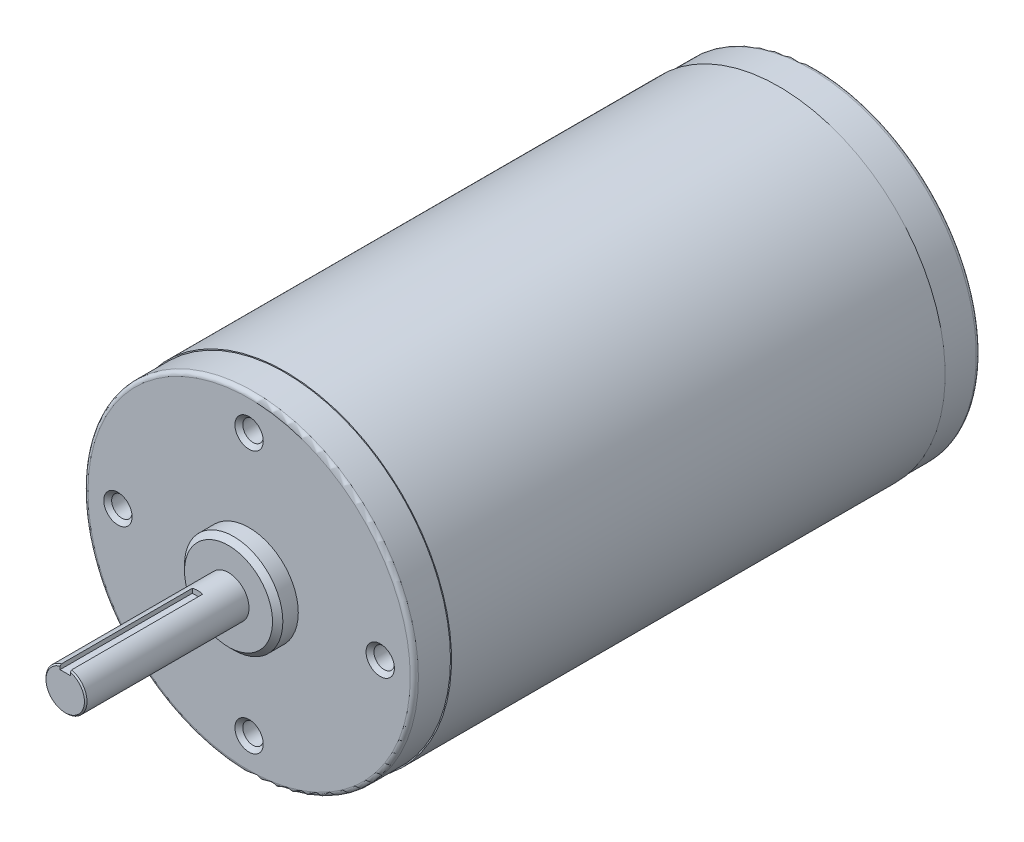
ISO-10303-21;
HEADER;
FILE_DESCRIPTION(('STEP AP214'),'2;1');
FILE_NAME('part.step','',(''),(''),'','','');
FILE_SCHEMA(('AUTOMOTIVE_DESIGN { 1 0 10303 214 1 1 1 1 }'));
ENDSEC;
DATA;
#1=APPLICATION_CONTEXT('core data for automotive mechanical design processes');
#2=APPLICATION_PROTOCOL_DEFINITION('international standard','automotive_design',2000,#1);
#3=PRODUCT_CONTEXT('',#1,'mechanical');
#4=PRODUCT('Part','Part','',(#3));
#5=PRODUCT_RELATED_PRODUCT_CATEGORY('part','',(#4));
#6=PRODUCT_DEFINITION_FORMATION('','',#4);
#7=PRODUCT_DEFINITION_CONTEXT('part definition',#1,'design');
#8=PRODUCT_DEFINITION('design','',#6,#7);
#9=PRODUCT_DEFINITION_SHAPE('','',#8);
#10=(LENGTH_UNIT() NAMED_UNIT(*) SI_UNIT(.MILLI.,.METRE.));
#11=(NAMED_UNIT(*) PLANE_ANGLE_UNIT() SI_UNIT($,.RADIAN.));
#12=(NAMED_UNIT(*) SI_UNIT($,.STERADIAN.) SOLID_ANGLE_UNIT());
#13=UNCERTAINTY_MEASURE_WITH_UNIT(LENGTH_MEASURE(1.E-05),#10,'distance_accuracy_value','');
#14=(GEOMETRIC_REPRESENTATION_CONTEXT(3) GLOBAL_UNCERTAINTY_ASSIGNED_CONTEXT((#13)) GLOBAL_UNIT_ASSIGNED_CONTEXT((#10,
#11,#12)) REPRESENTATION_CONTEXT('',''));
#15=CARTESIAN_POINT('',(0.,0.,0.));
#16=DIRECTION('',(0.,0.,1.));
#17=DIRECTION('',(1.,0.,0.));
#18=AXIS2_PLACEMENT_3D('',#15,#16,#17);
#19=CARTESIAN_POINT('',(0.,0.,42.6107999999999));
#20=DIRECTION('',(0.,0.,-1.));
#21=DIRECTION('',(-1.,0.,0.));
#22=AXIS2_PLACEMENT_3D('',#19,#20,#21);
#23=PLANE('',#22);
#24=DIRECTION('',(0.,1.,0.));
#25=VECTOR('',#24,1.);
#26=CARTESIAN_POINT('',(1.,0.,42.6107999999999));
#27=LINE('',#26,#25);
#28=CARTESIAN_POINT('',(1.,2.99999999999999,42.6107999999999));
#29=VERTEX_POINT('',#28);
#30=CARTESIAN_POINT('',(1.,3.58836592483648,42.610800000017));
#31=VERTEX_POINT('',#30);
#32=EDGE_CURVE('E108',#29,#31,#27,.T.);
#33=ORIENTED_EDGE('',*,*,#32,.F.);
#34=DIRECTION('',(1.,0.,0.));
#35=VECTOR('',#34,1.);
#36=CARTESIAN_POINT('',(-1.,2.99999999999999,42.6107999999999));
#37=LINE('',#36,#35);
#38=CARTESIAN_POINT('',(-1.,2.99999999999999,42.6107999999999));
#39=VERTEX_POINT('',#38);
#40=EDGE_CURVE('E74',#29,#39,#37,.F.);
#41=ORIENTED_EDGE('',*,*,#40,.T.);
#42=DIRECTION('',(0.,1.,0.));
#43=VECTOR('',#42,1.);
#44=CARTESIAN_POINT('',(-1.,0.,42.6107999999999));
#45=LINE('',#44,#43);
#46=CARTESIAN_POINT('',(-1.,3.58836592483648,42.610800000017));
#47=VERTEX_POINT('',#46);
#48=EDGE_CURVE('E55',#47,#39,#45,.F.);
#49=ORIENTED_EDGE('',*,*,#48,.F.);
#50=CARTESIAN_POINT('',(0.,0.,42.610800000034));
#51=DIRECTION('',(0.,0.,-1.));
#52=DIRECTION('',(-1.,0.,0.));
#53=AXIS2_PLACEMENT_3D('',#50,#51,#52);
#54=CIRCLE('',#53,3.72510000005377);
#55=EDGE_CURVE('E20',#31,#47,#54,.T.);
#56=ORIENTED_EDGE('',*,*,#55,.F.);
#57=EDGE_LOOP('',(#33,#41,#49,#56));
#58=FACE_BOUND('',#57,.T.);
#59=ADVANCED_FACE('F17',(#58),#23,.F.);
#60=CARTESIAN_POINT('',(-1.,2.99999999999999,42.6107999999999));
#61=DIRECTION('',(0.,-1.,0.));
#62=DIRECTION('',(0.,0.,-1.));
#63=AXIS2_PLACEMENT_3D('',#60,#61,#62);
#64=PLANE('',#63);
#65=DIRECTION('',(0.,0.,1.));
#66=VECTOR('',#65,1.);
#67=CARTESIAN_POINT('',(-1.,2.99999999999999,42.6107999999999));
#68=LINE('',#67,#66);
#69=CARTESIAN_POINT('',(-1.,2.99999999999999,16.9822));
#70=VERTEX_POINT('',#69);
#71=EDGE_CURVE('E111',#70,#39,#68,.T.);
#72=ORIENTED_EDGE('',*,*,#71,.T.);
#73=ORIENTED_EDGE('',*,*,#40,.F.);
#74=DIRECTION('',(0.,0.,-1.));
#75=VECTOR('',#74,1.);
#76=CARTESIAN_POINT('',(1.,2.99999999999999,42.6107999999999));
#77=LINE('',#76,#75);
#78=CARTESIAN_POINT('',(1.,2.99999999999999,16.9822));
#79=VERTEX_POINT('',#78);
#80=EDGE_CURVE('E70',#29,#79,#77,.T.);
#81=ORIENTED_EDGE('',*,*,#80,.T.);
#82=DIRECTION('',(1.,0.,0.));
#83=VECTOR('',#82,1.);
#84=CARTESIAN_POINT('',(0.,2.99999999999999,16.9822));
#85=LINE('',#84,#83);
#86=EDGE_CURVE('E73',#70,#79,#85,.T.);
#87=ORIENTED_EDGE('',*,*,#86,.F.);
#88=EDGE_LOOP('',(#72,#73,#81,#87));
#89=FACE_BOUND('',#88,.T.);
#90=ADVANCED_FACE('F72',(#89),#64,.F.);
#91=CARTESIAN_POINT('',(0.,0.,42.3608000000968));
#92=DIRECTION('',(0.,0.,-1.));
#93=DIRECTION('',(-1.,0.,0.));
#94=AXIS2_PLACEMENT_3D('',#91,#92,#93);
#95=CONICAL_SURFACE('',#94,3.97509999993417,0.785398163283761);
#96=CARTESIAN_POINT('',(1.,3.84726136493472,42.3608000000159));
#97=CARTESIAN_POINT('',(1.,3.80416108609981,42.4025173690307));
#98=CARTESIAN_POINT('',(1.,3.76103632691394,42.4442093866405));
#99=CARTESIAN_POINT('',(1.,3.67473784687307,42.5275427199842));
#100=CARTESIAN_POINT('',(1.,3.63156412601698,42.569184035717));
#101=CARTESIAN_POINT('',(1.,3.58836592480883,42.6108000000436));
#102=B_SPLINE_CURVE_WITH_KNOTS('',3,(#96,#97,#98,#99,#100,#101),.UNSPECIFIED.,.F.,.F.,(4,2,4),
(0.,0.179949222518309,0.359898449070208),.UNSPECIFIED.);
#103=CARTESIAN_POINT('',(1.,3.84726136492696,42.3608000000079));
#104=VERTEX_POINT('',#103);
#105=EDGE_CURVE('E88',#104,#31,#102,.T.);
#106=ORIENTED_EDGE('',*,*,#105,.T.);
#107=ORIENTED_EDGE('',*,*,#55,.T.);
#108=CARTESIAN_POINT('',(-1.,3.58836592480883,42.6108000000436));
#109=CARTESIAN_POINT('',(-1.,3.63156412601698,42.569184035717));
#110=CARTESIAN_POINT('',(-1.,3.67473784687307,42.5275427199842));
#111=CARTESIAN_POINT('',(-1.,3.76103632691394,42.4442093866405));
#112=CARTESIAN_POINT('',(-1.,3.80416108609981,42.4025173690307));
#113=CARTESIAN_POINT('',(-1.,3.84726136493472,42.3608000000159));
#114=B_SPLINE_CURVE_WITH_KNOTS('',3,(#108,#109,#110,#111,#112,#113),.UNSPECIFIED.,.F.,.F.,(4,2,
4),(0.,0.179949226551899,0.359898449070214),.UNSPECIFIED.);
#115=CARTESIAN_POINT('',(-1.,3.84726136492696,42.3608000000079));
#116=VERTEX_POINT('',#115);
#117=EDGE_CURVE('E81',#47,#116,#114,.T.);
#118=ORIENTED_EDGE('',*,*,#117,.T.);
#119=CARTESIAN_POINT('',(0.,0.,42.3607999999999));
#120=DIRECTION('',(0.,0.,1.));
#121=DIRECTION('',(1.,0.,0.));
#122=AXIS2_PLACEMENT_3D('',#119,#120,#121);
#123=CIRCLE('',#122,3.9751);
#124=EDGE_CURVE('E91',#104,#116,#123,.F.);
#125=ORIENTED_EDGE('',*,*,#124,.F.);
#126=EDGE_LOOP('',(#106,#107,#118,#125));
#127=FACE_BOUND('',#126,.T.);
#128=ADVANCED_FACE('F199',(#127),#95,.T.);
#129=CARTESIAN_POINT('',(-1.,3.84726136491921,42.6107999999999));
#130=DIRECTION('',(-1.,0.,0.));
#131=DIRECTION('',(0.,0.,1.));
#132=AXIS2_PLACEMENT_3D('',#129,#130,#131);
#133=PLANE('',#132);
#134=ORIENTED_EDGE('',*,*,#48,.T.);
#135=ORIENTED_EDGE('',*,*,#71,.F.);
#136=DIRECTION('',(0.,-1.,0.));
#137=VECTOR('',#136,1.);
#138=CARTESIAN_POINT('',(-1.,3.45234055060212,16.9822));
#139=LINE('',#138,#137);
#140=CARTESIAN_POINT('',(-1.,3.84726136491921,16.9822));
#141=VERTEX_POINT('',#140);
#142=EDGE_CURVE('E77',#141,#70,#139,.T.);
#143=ORIENTED_EDGE('',*,*,#142,.F.);
#144=DIRECTION('',(0.,0.,1.));
#145=VECTOR('',#144,1.);
#146=CARTESIAN_POINT('',(-1.,3.84726136491921,10.9878));
#147=LINE('',#146,#145);
#148=EDGE_CURVE('E100',#116,#141,#147,.F.);
#149=ORIENTED_EDGE('',*,*,#148,.F.);
#150=ORIENTED_EDGE('',*,*,#117,.F.);
#151=EDGE_LOOP('',(#134,#135,#143,#149,#150));
#152=FACE_BOUND('',#151,.T.);
#153=ADVANCED_FACE('F202',(#152),#133,.F.);
#154=CARTESIAN_POINT('',(0.,3.45234055060212,16.9822));
#155=DIRECTION('',(0.,0.,1.));
#156=DIRECTION('',(0.,-1.,0.));
#157=AXIS2_PLACEMENT_3D('',#154,#155,#156);
#158=PLANE('',#157);
#159=CARTESIAN_POINT('',(0.,0.,16.9822));
#160=DIRECTION('',(0.,0.,1.));
#161=DIRECTION('',(1.,0.,0.));
#162=AXIS2_PLACEMENT_3D('',#159,#160,#161);
#163=CIRCLE('',#162,3.9751);
#164=CARTESIAN_POINT('',(1.,3.84726136491921,16.9822));
#165=VERTEX_POINT('',#164);
#166=EDGE_CURVE('E186',#141,#165,#163,.F.);
#167=ORIENTED_EDGE('',*,*,#166,.F.);
#168=ORIENTED_EDGE('',*,*,#142,.T.);
#169=ORIENTED_EDGE('',*,*,#86,.T.);
#170=DIRECTION('',(0.,1.,0.));
#171=VECTOR('',#170,1.);
#172=CARTESIAN_POINT('',(1.,2.99999999999999,16.9822));
#173=LINE('',#172,#171);
#174=EDGE_CURVE('E35',#79,#165,#173,.T.);
#175=ORIENTED_EDGE('',*,*,#174,.T.);
#176=EDGE_LOOP('',(#167,#168,#169,#175));
#177=FACE_BOUND('',#176,.T.);
#178=ADVANCED_FACE('F80',(#177),#158,.T.);
#179=CARTESIAN_POINT('',(1.,2.99999999999999,42.6107999999999));
#180=DIRECTION('',(1.,0.,0.));
#181=DIRECTION('',(0.,0.,-1.));
#182=AXIS2_PLACEMENT_3D('',#179,#180,#181);
#183=PLANE('',#182);
#184=DIRECTION('',(0.,0.,1.));
#185=VECTOR('',#184,1.);
#186=CARTESIAN_POINT('',(1.,3.84726136491921,10.9878));
#187=LINE('',#186,#185);
#188=EDGE_CURVE('E86',#165,#104,#187,.T.);
#189=ORIENTED_EDGE('',*,*,#188,.F.);
#190=ORIENTED_EDGE('',*,*,#174,.F.);
#191=ORIENTED_EDGE('',*,*,#80,.F.);
#192=ORIENTED_EDGE('',*,*,#32,.T.);
#193=ORIENTED_EDGE('',*,*,#105,.F.);
#194=EDGE_LOOP('',(#189,#190,#191,#192,#193));
#195=FACE_BOUND('',#194,.T.);
#196=ADVANCED_FACE('F83',(#195),#183,.F.);
#197=CARTESIAN_POINT('',(0.,25.4,-98.7955999999999));
#198=DIRECTION('',(0.,0.,-1.));
#199=DIRECTION('',(-1.,0.,0.));
#200=AXIS2_PLACEMENT_3D('',#197,#198,#199);
#201=CYLINDRICAL_SURFACE('',#200,2.54);
#202=CARTESIAN_POINT('',(0.,25.4,-94.9856000000295));
#203=DIRECTION('',(0.,0.,-1.));
#204=DIRECTION('',(-1.,0.,0.));
#205=AXIS2_PLACEMENT_3D('',#202,#203,#204);
#206=CIRCLE('',#205,2.54000000006727);
#207=CARTESIAN_POINT('',(-2.54000000006727,25.4,-94.9856000000295));
#208=VERTEX_POINT('',#207);
#209=EDGE_CURVE('E179',#208,#208,#206,.F.);
#210=ORIENTED_EDGE('',*,*,#209,.T.);
#211=EDGE_LOOP('',(#210));
#212=FACE_BOUND('',#211,.T.);
#213=CARTESIAN_POINT('',(0.,25.4,-98.0336));
#214=DIRECTION('',(0.,0.,-1.));
#215=DIRECTION('',(-1.,0.,0.));
#216=AXIS2_PLACEMENT_3D('',#213,#214,#215);
#217=CIRCLE('',#216,2.54);
#218=CARTESIAN_POINT('',(-2.54,25.4,-98.0336));
#219=VERTEX_POINT('',#218);
#220=EDGE_CURVE('E180',#219,#219,#217,.F.);
#221=ORIENTED_EDGE('',*,*,#220,.F.);
#222=EDGE_LOOP('',(#221));
#223=FACE_BOUND('',#222,.T.);
#224=ADVANCED_FACE('F383',(#212,#223),#201,.F.);
#225=CARTESIAN_POINT('',(0.,0.,10.9878));
#226=DIRECTION('',(0.,0.,1.));
#227=DIRECTION('',(1.,0.,0.));
#228=AXIS2_PLACEMENT_3D('',#225,#226,#227);
#229=CYLINDRICAL_SURFACE('',#228,3.9751);
#230=CARTESIAN_POINT('',(0.,0.,10.9878));
#231=DIRECTION('',(0.,0.,1.));
#232=DIRECTION('',(1.,0.,0.));
#233=AXIS2_PLACEMENT_3D('',#230,#231,#232);
#234=CIRCLE('',#233,3.9751);
#235=CARTESIAN_POINT('',(3.9751,0.,10.9878));
#236=VERTEX_POINT('',#235);
#237=EDGE_CURVE('E176',#236,#236,#234,.T.);
#238=ORIENTED_EDGE('',*,*,#237,.T.);
#239=EDGE_LOOP('',(#238));
#240=FACE_BOUND('',#239,.T.);
#241=ORIENTED_EDGE('',*,*,#166,.T.);
#242=ORIENTED_EDGE('',*,*,#188,.T.);
#243=ORIENTED_EDGE('',*,*,#124,.T.);
#244=ORIENTED_EDGE('',*,*,#148,.T.);
#245=EDGE_LOOP('',(#241,#242,#243,#244));
#246=FACE_BOUND('',#245,.T.);
#247=ADVANCED_FACE('F375',(#240,#246),#229,.T.);
#248=CARTESIAN_POINT('',(0.,-25.4,-98.7955999999999));
#249=DIRECTION('',(0.,0.,-1.));
#250=DIRECTION('',(-1.,0.,0.));
#251=AXIS2_PLACEMENT_3D('',#248,#249,#250);
#252=CYLINDRICAL_SURFACE('',#251,2.54);
#253=CARTESIAN_POINT('',(0.,-25.4,-94.9856000000295));
#254=DIRECTION('',(0.,0.,-1.));
#255=DIRECTION('',(1.,0.,0.));
#256=AXIS2_PLACEMENT_3D('',#253,#254,#255);
#257=CIRCLE('',#256,2.54000000006727);
#258=CARTESIAN_POINT('',(2.54000000006727,-25.4,-94.9856000000295));
#259=VERTEX_POINT('',#258);
#260=EDGE_CURVE('E175',#259,#259,#257,.F.);
#261=ORIENTED_EDGE('',*,*,#260,.T.);
#262=EDGE_LOOP('',(#261));
#263=FACE_BOUND('',#262,.T.);
#264=CARTESIAN_POINT('',(0.,-25.4,-98.0336));
#265=DIRECTION('',(0.,0.,-1.));
#266=DIRECTION('',(-1.,0.,0.));
#267=AXIS2_PLACEMENT_3D('',#264,#265,#266);
#268=CIRCLE('',#267,2.54);
#269=CARTESIAN_POINT('',(-2.54,-25.4,-98.0336));
#270=VERTEX_POINT('',#269);
#271=EDGE_CURVE('E183',#270,#270,#268,.F.);
#272=ORIENTED_EDGE('',*,*,#271,.F.);
#273=EDGE_LOOP('',(#272));
#274=FACE_BOUND('',#273,.T.);
#275=ADVANCED_FACE('F391',(#263,#274),#252,.F.);
#276=CARTESIAN_POINT('',(0.,-25.4,-98.0336));
#277=DIRECTION('',(0.,0.,-1.));
#278=DIRECTION('',(-1.,0.,0.));
#279=AXIS2_PLACEMENT_3D('',#276,#277,#278);
#280=PLANE('',#279);
#281=ORIENTED_EDGE('',*,*,#271,.T.);
#282=EDGE_LOOP('',(#281));
#283=FACE_BOUND('',#282,.T.);
#284=CARTESIAN_POINT('',(0.,-25.4,-98.0336));
#285=DIRECTION('',(0.,0.,-1.));
#286=DIRECTION('',(-1.,0.,0.));
#287=AXIS2_PLACEMENT_3D('',#284,#285,#286);
#288=CIRCLE('',#287,4.953);
#289=CARTESIAN_POINT('',(-4.953,-25.4,-98.0336));
#290=VERTEX_POINT('',#289);
#291=EDGE_CURVE('E172',#290,#290,#288,.T.);
#292=ORIENTED_EDGE('',*,*,#291,.T.);
#293=EDGE_LOOP('',(#292));
#294=FACE_BOUND('',#293,.T.);
#295=ADVANCED_FACE('F399',(#283,#294),#280,.T.);
#296=CARTESIAN_POINT('',(0.,0.,-106.7204));
#297=DIRECTION('',(0.,0.,1.));
#298=DIRECTION('',(1.,0.,0.));
#299=AXIS2_PLACEMENT_3D('',#296,#297,#298);
#300=PLANE('',#299);
#301=CARTESIAN_POINT('',(0.,0.,-106.7204));
#302=DIRECTION('',(0.,0.,1.));
#303=DIRECTION('',(-1.,0.,0.));
#304=AXIS2_PLACEMENT_3D('',#301,#302,#303);
#305=CIRCLE('',#304,14.3129);
#306=CARTESIAN_POINT('',(-14.3129,0.,-106.7204));
#307=VERTEX_POINT('',#306);
#308=EDGE_CURVE('E171',#307,#307,#305,.T.);
#309=ORIENTED_EDGE('',*,*,#308,.F.);
#310=EDGE_LOOP('',(#309));
#311=FACE_BOUND('',#310,.T.);
#312=ADVANCED_FACE('F403',(#311),#300,.F.);
#313=CARTESIAN_POINT('',(0.,25.4,-98.0336));
#314=DIRECTION('',(0.,0.,-1.));
#315=DIRECTION('',(-1.,0.,0.));
#316=AXIS2_PLACEMENT_3D('',#313,#314,#315);
#317=PLANE('',#316);
#318=ORIENTED_EDGE('',*,*,#220,.T.);
#319=EDGE_LOOP('',(#318));
#320=FACE_BOUND('',#319,.T.);
#321=CARTESIAN_POINT('',(0.,25.4,-98.0336));
#322=DIRECTION('',(0.,0.,-1.));
#323=DIRECTION('',(-1.,0.,0.));
#324=AXIS2_PLACEMENT_3D('',#321,#322,#323);
#325=CIRCLE('',#324,4.953);
#326=CARTESIAN_POINT('',(-4.953,25.4,-98.0336));
#327=VERTEX_POINT('',#326);
#328=EDGE_CURVE('E168',#327,#327,#325,.T.);
#329=ORIENTED_EDGE('',*,*,#328,.T.);
#330=EDGE_LOOP('',(#329));
#331=FACE_BOUND('',#330,.T.);
#332=ADVANCED_FACE('F408',(#320,#331),#317,.T.);
#333=CARTESIAN_POINT('',(0.,25.4,-94.9856000000295));
#334=DIRECTION('',(0.,0.,-1.));
#335=DIRECTION('',(-1.,0.,0.));
#336=AXIS2_PLACEMENT_3D('',#333,#334,#335);
#337=CONICAL_SURFACE('',#336,2.54000000006727,1.02974425866343);
#338=ORIENTED_EDGE('',*,*,#209,.F.);
#339=EDGE_LOOP('',(#338));
#340=FACE_BOUND('',#339,.T.);
#341=CARTESIAN_POINT('',(0.,25.4,-94.6498390860875));
#342=DIRECTION('',(0.,0.,1.));
#343=DIRECTION('',(1.,0.,0.));
#344=AXIS2_PLACEMENT_3D('',#341,#342,#343);
#345=CIRCLE('',#344,1.9812);
#346=CARTESIAN_POINT('',(1.98120000000001,25.4,-94.6498390860875));
#347=VERTEX_POINT('',#346);
#348=EDGE_CURVE('E167',#347,#347,#345,.T.);
#349=ORIENTED_EDGE('',*,*,#348,.T.);
#350=EDGE_LOOP('',(#349));
#351=FACE_BOUND('',#350,.T.);
#352=ADVANCED_FACE('F426',(#340,#351),#337,.F.);
#353=CARTESIAN_POINT('',(0.,0.,-95.6056));
#354=DIRECTION('',(0.,0.,1.));
#355=DIRECTION('',(1.,0.,0.));
#356=AXIS2_PLACEMENT_3D('',#353,#354,#355);
#357=PLANE('',#356);
#358=CARTESIAN_POINT('',(25.4,0.,-95.6056));
#359=DIRECTION('',(0.,0.,1.));
#360=DIRECTION('',(1.,0.,0.));
#361=AXIS2_PLACEMENT_3D('',#358,#359,#360);
#362=CIRCLE('',#361,1.9812);
#363=CARTESIAN_POINT('',(27.3812,0.,-95.6056));
#364=VERTEX_POINT('',#363);
#365=EDGE_CURVE('E164',#364,#364,#362,.T.);
#366=ORIENTED_EDGE('',*,*,#365,.T.);
#367=EDGE_LOOP('',(#366));
#368=FACE_BOUND('',#367,.T.);
#369=ADVANCED_FACE('F429',(#368),#357,.T.);
#370=CARTESIAN_POINT('',(0.,0.,10.9878));
#371=DIRECTION('',(0.,0.,-1.));
#372=DIRECTION('',(-1.,0.,0.));
#373=AXIS2_PLACEMENT_3D('',#370,#371,#372);
#374=PLANE('',#373);
#375=CARTESIAN_POINT('',(0.,0.,10.9877999999987));
#376=DIRECTION('',(0.,0.,-1.));
#377=DIRECTION('',(-1.,0.,0.));
#378=AXIS2_PLACEMENT_3D('',#375,#376,#377);
#379=CIRCLE('',#378,8.52499999999872);
#380=CARTESIAN_POINT('',(-8.52499999999872,0.,10.9877999999987));
#381=VERTEX_POINT('',#380);
#382=EDGE_CURVE('E161',#381,#381,#379,.T.);
#383=ORIENTED_EDGE('',*,*,#382,.F.);
#384=EDGE_LOOP('',(#383));
#385=FACE_BOUND('',#384,.T.);
#386=ORIENTED_EDGE('',*,*,#237,.F.);
#387=EDGE_LOOP('',(#386));
#388=FACE_BOUND('',#387,.T.);
#389=ADVANCED_FACE('F495',(#385,#388),#374,.F.);
#390=CARTESIAN_POINT('',(0.,-25.4,-94.9856000000295));
#391=DIRECTION('',(0.,0.,-1.));
#392=DIRECTION('',(-1.,0.,0.));
#393=AXIS2_PLACEMENT_3D('',#390,#391,#392);
#394=CONICAL_SURFACE('',#393,2.54000000006727,1.02974425866343);
#395=ORIENTED_EDGE('',*,*,#260,.F.);
#396=EDGE_LOOP('',(#395));
#397=FACE_BOUND('',#396,.T.);
#398=CARTESIAN_POINT('',(0.,-25.4,-94.6498390860875));
#399=DIRECTION('',(0.,0.,1.));
#400=DIRECTION('',(1.,0.,0.));
#401=AXIS2_PLACEMENT_3D('',#398,#399,#400);
#402=CIRCLE('',#401,1.9812);
#403=CARTESIAN_POINT('',(1.98119999999999,-25.4,-94.6498390860875));
#404=VERTEX_POINT('',#403);
#405=EDGE_CURVE('E160',#404,#404,#402,.T.);
#406=ORIENTED_EDGE('',*,*,#405,.T.);
#407=EDGE_LOOP('',(#406));
#408=FACE_BOUND('',#407,.T.);
#409=ADVANCED_FACE('F492',(#397,#408),#394,.F.);
#410=CARTESIAN_POINT('',(0.,0.,0.));
#411=DIRECTION('',(0.,0.,1.));
#412=DIRECTION('',(1.,0.,0.));
#413=AXIS2_PLACEMENT_3D('',#410,#411,#412);
#414=PLANE('',#413);
#415=CARTESIAN_POINT('',(-25.4,0.,0.));
#416=DIRECTION('',(0.,0.,1.));
#417=DIRECTION('',(1.,0.,0.));
#418=AXIS2_PLACEMENT_3D('',#415,#416,#417);
#419=CIRCLE('',#418,1.9812);
#420=CARTESIAN_POINT('',(-23.4188,0.,0.));
#421=VERTEX_POINT('',#420);
#422=EDGE_CURVE('E156',#421,#421,#419,.T.);
#423=ORIENTED_EDGE('',*,*,#422,.T.);
#424=EDGE_LOOP('',(#423));
#425=FACE_BOUND('',#424,.T.);
#426=ADVANCED_FACE('F494',(#425),#414,.T.);
#427=CARTESIAN_POINT('',(0.,-25.4,-100.3196));
#428=DIRECTION('',(0.,0.,-1.));
#429=DIRECTION('',(-1.,0.,0.));
#430=AXIS2_PLACEMENT_3D('',#427,#428,#429);
#431=CYLINDRICAL_SURFACE('',#430,4.953);
#432=CARTESIAN_POINT('',(0.,-25.4,-102.097600000036));
#433=DIRECTION('',(0.,0.,-1.));
#434=DIRECTION('',(-1.,0.,0.));
#435=AXIS2_PLACEMENT_3D('',#432,#433,#434);
#436=CIRCLE('',#435,4.95300000000043);
#437=CARTESIAN_POINT('',(-4.95300000000043,-25.4,-102.097600000036));
#438=VERTEX_POINT('',#437);
#439=EDGE_CURVE('E159',#438,#438,#436,.T.);
#440=ORIENTED_EDGE('',*,*,#439,.T.);
#441=EDGE_LOOP('',(#440));
#442=FACE_BOUND('',#441,.T.);
#443=ORIENTED_EDGE('',*,*,#291,.F.);
#444=EDGE_LOOP('',(#443));
#445=FACE_BOUND('',#444,.T.);
#446=ADVANCED_FACE('F354',(#442,#445),#431,.F.);
#447=CARTESIAN_POINT('',(0.,0.,-105.9584));
#448=DIRECTION('',(0.,0.,1.));
#449=DIRECTION('',(1.,0.,0.));
#450=AXIS2_PLACEMENT_3D('',#447,#448,#449);
#451=TOROIDAL_SURFACE('',#450,14.3129,0.762);
#452=CARTESIAN_POINT('',(0.,0.,-105.9584));
#453=DIRECTION('',(0.,0.,-1.));
#454=DIRECTION('',(-1.,0.,0.));
#455=AXIS2_PLACEMENT_3D('',#452,#453,#454);
#456=CIRCLE('',#455,15.0749);
#457=CARTESIAN_POINT('',(-15.0749,0.,-105.9584));
#458=VERTEX_POINT('',#457);
#459=EDGE_CURVE('E325',#458,#458,#456,.F.);
#460=ORIENTED_EDGE('',*,*,#459,.F.);
#461=EDGE_LOOP('',(#460));
#462=FACE_BOUND('',#461,.T.);
#463=ORIENTED_EDGE('',*,*,#308,.T.);
#464=EDGE_LOOP('',(#463));
#465=FACE_BOUND('',#464,.T.);
#466=ADVANCED_FACE('F348',(#462,#465),#451,.T.);
#467=CARTESIAN_POINT('',(0.,25.4,-100.3196));
#468=DIRECTION('',(0.,0.,-1.));
#469=DIRECTION('',(-1.,0.,0.));
#470=AXIS2_PLACEMENT_3D('',#467,#468,#469);
#471=CYLINDRICAL_SURFACE('',#470,4.953);
#472=CARTESIAN_POINT('',(0.,25.4,-102.097600000036));
#473=DIRECTION('',(0.,0.,-1.));
#474=DIRECTION('',(1.,0.,0.));
#475=AXIS2_PLACEMENT_3D('',#472,#473,#474);
#476=CIRCLE('',#475,4.95300000000042);
#477=CARTESIAN_POINT('',(4.95300000000043,25.4,-102.097600000036));
#478=VERTEX_POINT('',#477);
#479=EDGE_CURVE('E320',#478,#478,#476,.T.);
#480=ORIENTED_EDGE('',*,*,#479,.T.);
#481=EDGE_LOOP('',(#480));
#482=FACE_BOUND('',#481,.T.);
#483=ORIENTED_EDGE('',*,*,#328,.F.);
#484=EDGE_LOOP('',(#483));
#485=FACE_BOUND('',#484,.T.);
#486=ADVANCED_FACE('F353',(#482,#485),#471,.F.);
#487=CARTESIAN_POINT('',(0.,25.4,-84.185414825179));
#488=DIRECTION('',(0.,0.,1.));
#489=DIRECTION('',(1.,0.,0.));
#490=AXIS2_PLACEMENT_3D('',#487,#488,#489);
#491=CYLINDRICAL_SURFACE('',#490,1.9812);
#492=CARTESIAN_POINT('',(0.,25.4,6.23799999999619));
#493=DIRECTION('',(0.,0.,1.));
#494=DIRECTION('',(0.,-1.,0.));
#495=AXIS2_PLACEMENT_3D('',#492,#493,#494);
#496=CIRCLE('',#495,1.98119999994142);
#497=CARTESIAN_POINT('',(0.,23.4188000000586,6.23799999999619));
#498=VERTEX_POINT('',#497);
#499=EDGE_CURVE('E315',#498,#498,#496,.T.);
#500=ORIENTED_EDGE('',*,*,#499,.T.);
#501=EDGE_LOOP('',(#500));
#502=FACE_BOUND('',#501,.T.);
#503=ORIENTED_EDGE('',*,*,#348,.F.);
#504=EDGE_LOOP('',(#503));
#505=FACE_BOUND('',#504,.T.);
#506=ADVANCED_FACE('F432',(#502,#505),#491,.F.);
#507=CARTESIAN_POINT('',(25.4,0.,-84.185414825179));
#508=DIRECTION('',(0.,0.,1.));
#509=DIRECTION('',(1.,0.,0.));
#510=AXIS2_PLACEMENT_3D('',#507,#508,#509);
#511=CYLINDRICAL_SURFACE('',#510,1.9812);
#512=CARTESIAN_POINT('',(25.4,0.,6.23799999999619));
#513=DIRECTION('',(0.,0.,1.));
#514=DIRECTION('',(-1.,0.,0.));
#515=AXIS2_PLACEMENT_3D('',#512,#513,#514);
#516=CIRCLE('',#515,1.98119999994142);
#517=CARTESIAN_POINT('',(23.4188000000586,0.,6.23799999999619));
#518=VERTEX_POINT('',#517);
#519=EDGE_CURVE('E310',#518,#518,#516,.T.);
#520=ORIENTED_EDGE('',*,*,#519,.T.);
#521=EDGE_LOOP('',(#520));
#522=FACE_BOUND('',#521,.T.);
#523=ORIENTED_EDGE('',*,*,#365,.F.);
#524=EDGE_LOOP('',(#523));
#525=FACE_BOUND('',#524,.T.);
#526=ADVANCED_FACE('F434',(#522,#525),#511,.F.);
#527=CARTESIAN_POINT('',(0.,0.,9.98780000000128));
#528=DIRECTION('',(0.,0.,-1.));
#529=DIRECTION('',(-1.,0.,0.));
#530=AXIS2_PLACEMENT_3D('',#527,#528,#529);
#531=CONICAL_SURFACE('',#530,9.52500000000128,0.7853981634);
#532=CARTESIAN_POINT('',(0.,0.,9.9878));
#533=DIRECTION('',(0.,0.,1.));
#534=DIRECTION('',(1.,0.,0.));
#535=AXIS2_PLACEMENT_3D('',#532,#533,#534);
#536=CIRCLE('',#535,9.525);
#537=CARTESIAN_POINT('',(9.525,0.,9.9878));
#538=VERTEX_POINT('',#537);
#539=EDGE_CURVE('E305',#538,#538,#536,.F.);
#540=ORIENTED_EDGE('',*,*,#539,.F.);
#541=EDGE_LOOP('',(#540));
#542=FACE_BOUND('',#541,.T.);
#543=ORIENTED_EDGE('',*,*,#382,.T.);
#544=EDGE_LOOP('',(#543));
#545=FACE_BOUND('',#544,.T.);
#546=ADVANCED_FACE('F440',(#542,#545),#531,.T.);
#547=CARTESIAN_POINT('',(0.,-25.4,-84.185414825179));
#548=DIRECTION('',(0.,0.,1.));
#549=DIRECTION('',(1.,0.,0.));
#550=AXIS2_PLACEMENT_3D('',#547,#548,#549);
#551=CYLINDRICAL_SURFACE('',#550,1.9812);
#552=CARTESIAN_POINT('',(0.,-25.4,6.23799999999619));
#553=DIRECTION('',(0.,0.,1.));
#554=DIRECTION('',(0.,1.,0.));
#555=AXIS2_PLACEMENT_3D('',#552,#553,#554);
#556=CIRCLE('',#555,1.98119999994142);
#557=CARTESIAN_POINT('',(0.,-23.4188000000586,6.23799999999619));
#558=VERTEX_POINT('',#557);
#559=EDGE_CURVE('E300',#558,#558,#556,.T.);
#560=ORIENTED_EDGE('',*,*,#559,.T.);
#561=EDGE_LOOP('',(#560));
#562=FACE_BOUND('',#561,.T.);
#563=ORIENTED_EDGE('',*,*,#405,.F.);
#564=EDGE_LOOP('',(#563));
#565=FACE_BOUND('',#564,.T.);
#566=ADVANCED_FACE('F447',(#562,#565),#551,.F.);
#567=CARTESIAN_POINT('',(-25.4,0.,-84.185414825179));
#568=DIRECTION('',(0.,0.,1.));
#569=DIRECTION('',(1.,0.,0.));
#570=AXIS2_PLACEMENT_3D('',#567,#568,#569);
#571=CYLINDRICAL_SURFACE('',#570,1.9812);
#572=CARTESIAN_POINT('',(-25.4,0.,6.23799999999619));
#573=DIRECTION('',(0.,0.,1.));
#574=DIRECTION('',(1.,0.,0.));
#575=AXIS2_PLACEMENT_3D('',#572,#573,#574);
#576=CIRCLE('',#575,1.98119999994142);
#577=CARTESIAN_POINT('',(-23.4188000000586,0.,6.23799999999619));
#578=VERTEX_POINT('',#577);
#579=EDGE_CURVE('E155',#578,#578,#576,.T.);
#580=ORIENTED_EDGE('',*,*,#579,.T.);
#581=EDGE_LOOP('',(#580));
#582=FACE_BOUND('',#581,.T.);
#583=ORIENTED_EDGE('',*,*,#422,.F.);
#584=EDGE_LOOP('',(#583));
#585=FACE_BOUND('',#584,.T.);
#586=ADVANCED_FACE('F451',(#582,#585),#571,.F.);
#587=CARTESIAN_POINT('',(0.,-25.4,-102.605600000004));
#588=DIRECTION('',(0.,0.,-1.));
#589=DIRECTION('',(0.,1.,0.));
#590=AXIS2_PLACEMENT_3D('',#587,#588,#589);
#591=CONICAL_SURFACE('',#590,5.46099999996841,0.785398163397448);
#592=CARTESIAN_POINT('',(0.,-25.4,-102.605600000004));
#593=DIRECTION('',(0.,0.,-1.));
#594=DIRECTION('',(0.,1.,0.));
#595=AXIS2_PLACEMENT_3D('',#592,#593,#594);
#596=CIRCLE('',#595,5.46099999996841);
#597=CARTESIAN_POINT('',(0.,-19.9390000000316,-102.605600000004));
#598=VERTEX_POINT('',#597);
#599=EDGE_CURVE('E152',#598,#598,#596,.T.);
#600=ORIENTED_EDGE('',*,*,#599,.T.);
#601=EDGE_LOOP('',(#600));
#602=FACE_BOUND('',#601,.T.);
#603=ORIENTED_EDGE('',*,*,#439,.F.);
#604=EDGE_LOOP('',(#603));
#605=FACE_BOUND('',#604,.T.);
#606=ADVANCED_FACE('F455',(#602,#605),#591,.F.);
#607=CARTESIAN_POINT('',(0.,0.,-102.6056));
#608=DIRECTION('',(0.,0.,-1.));
#609=DIRECTION('',(-1.,0.,0.));
#610=AXIS2_PLACEMENT_3D('',#607,#608,#609);
#611=CYLINDRICAL_SURFACE('',#610,15.0749);
#612=ORIENTED_EDGE('',*,*,#459,.T.);
#613=EDGE_LOOP('',(#612));
#614=FACE_BOUND('',#613,.T.);
#615=CARTESIAN_POINT('',(0.,0.,-102.6056));
#616=DIRECTION('',(0.,0.,-1.));
#617=DIRECTION('',(-1.,0.,0.));
#618=AXIS2_PLACEMENT_3D('',#615,#616,#617);
#619=CIRCLE('',#618,15.0749);
#620=CARTESIAN_POINT('',(-15.0749,0.,-102.6056));
#621=VERTEX_POINT('',#620);
#622=EDGE_CURVE('E149',#621,#621,#619,.T.);
#623=ORIENTED_EDGE('',*,*,#622,.T.);
#624=EDGE_LOOP('',(#623));
#625=FACE_BOUND('',#624,.T.);
#626=ADVANCED_FACE('F459',(#614,#625),#611,.T.);
#627=CARTESIAN_POINT('',(0.,25.4,-102.605600000004));
#628=DIRECTION('',(0.,0.,-1.));
#629=DIRECTION('',(0.,1.,0.));
#630=AXIS2_PLACEMENT_3D('',#627,#628,#629);
#631=CONICAL_SURFACE('',#630,5.4609999999684,0.785398163397448);
#632=CARTESIAN_POINT('',(0.,25.4,-102.605600000004));
#633=DIRECTION('',(0.,0.,-1.));
#634=DIRECTION('',(0.,1.,0.));
#635=AXIS2_PLACEMENT_3D('',#632,#633,#634);
#636=CIRCLE('',#635,5.4609999999684);
#637=CARTESIAN_POINT('',(0.,30.8609999999684,-102.605600000004));
#638=VERTEX_POINT('',#637);
#639=EDGE_CURVE('E146',#638,#638,#636,.T.);
#640=ORIENTED_EDGE('',*,*,#639,.T.);
#641=EDGE_LOOP('',(#640));
#642=FACE_BOUND('',#641,.T.);
#643=ORIENTED_EDGE('',*,*,#479,.F.);
#644=EDGE_LOOP('',(#643));
#645=FACE_BOUND('',#644,.T.);
#646=ADVANCED_FACE('F463',(#642,#645),#631,.F.);
#647=CARTESIAN_POINT('',(0.,25.4,7.000000000005));
#648=DIRECTION('',(0.,0.,1.));
#649=DIRECTION('',(1.,0.,0.));
#650=AXIS2_PLACEMENT_3D('',#647,#648,#649);
#651=CONICAL_SURFACE('',#650,2.74319999989339,0.785398163360149);
#652=CARTESIAN_POINT('',(0.,25.4,7.00000000006185));
#653=DIRECTION('',(0.,0.,1.));
#654=DIRECTION('',(1.,0.,0.));
#655=AXIS2_PLACEMENT_3D('',#652,#653,#654);
#656=CIRCLE('',#655,2.74319999995023);
#657=CARTESIAN_POINT('',(2.74319999995023,25.4,7.00000000006185));
#658=VERTEX_POINT('',#657);
#659=EDGE_CURVE('E143',#658,#658,#656,.T.);
#660=ORIENTED_EDGE('',*,*,#659,.T.);
#661=EDGE_LOOP('',(#660));
#662=FACE_BOUND('',#661,.T.);
#663=ORIENTED_EDGE('',*,*,#499,.F.);
#664=EDGE_LOOP('',(#663));
#665=FACE_BOUND('',#664,.T.);
#666=ADVANCED_FACE('F467',(#662,#665),#651,.F.);
#667=CARTESIAN_POINT('',(25.4,0.,7.000000000005));
#668=DIRECTION('',(0.,0.,1.));
#669=DIRECTION('',(1.,0.,0.));
#670=AXIS2_PLACEMENT_3D('',#667,#668,#669);
#671=CONICAL_SURFACE('',#670,2.74319999989339,0.785398163360149);
#672=CARTESIAN_POINT('',(25.4,0.,7.00000000006185));
#673=DIRECTION('',(0.,0.,1.));
#674=DIRECTION('',(1.,0.,0.));
#675=AXIS2_PLACEMENT_3D('',#672,#673,#674);
#676=CIRCLE('',#675,2.74319999995023);
#677=CARTESIAN_POINT('',(28.1431999999502,0.,7.00000000006185));
#678=VERTEX_POINT('',#677);
#679=EDGE_CURVE('E140',#678,#678,#676,.T.);
#680=ORIENTED_EDGE('',*,*,#679,.T.);
#681=EDGE_LOOP('',(#680));
#682=FACE_BOUND('',#681,.T.);
#683=ORIENTED_EDGE('',*,*,#519,.F.);
#684=EDGE_LOOP('',(#683));
#685=FACE_BOUND('',#684,.T.);
#686=ADVANCED_FACE('F471',(#682,#685),#671,.F.);
#687=CARTESIAN_POINT('',(0.,0.,6.99999999999999));
#688=DIRECTION('',(0.,0.,1.));
#689=DIRECTION('',(1.,0.,0.));
#690=AXIS2_PLACEMENT_3D('',#687,#688,#689);
#691=CYLINDRICAL_SURFACE('',#690,9.525);
#692=ORIENTED_EDGE('',*,*,#539,.T.);
#693=EDGE_LOOP('',(#692));
#694=FACE_BOUND('',#693,.T.);
#695=CARTESIAN_POINT('',(0.,0.,6.99999999999999));
#696=DIRECTION('',(0.,0.,1.));
#697=DIRECTION('',(1.,0.,0.));
#698=AXIS2_PLACEMENT_3D('',#695,#696,#697);
#699=CIRCLE('',#698,9.525);
#700=CARTESIAN_POINT('',(9.525,0.,6.99999999999999));
#701=VERTEX_POINT('',#700);
#702=EDGE_CURVE('E137',#701,#701,#699,.T.);
#703=ORIENTED_EDGE('',*,*,#702,.T.);
#704=EDGE_LOOP('',(#703));
#705=FACE_BOUND('',#704,.T.);
#706=ADVANCED_FACE('F475',(#694,#705),#691,.T.);
#707=CARTESIAN_POINT('',(0.,-25.4,7.000000000005));
#708=DIRECTION('',(0.,0.,1.));
#709=DIRECTION('',(1.,0.,0.));
#710=AXIS2_PLACEMENT_3D('',#707,#708,#709);
#711=CONICAL_SURFACE('',#710,2.74319999989339,0.785398163360149);
#712=CARTESIAN_POINT('',(0.,-25.4,7.00000000006185));
#713=DIRECTION('',(0.,0.,1.));
#714=DIRECTION('',(1.,0.,0.));
#715=AXIS2_PLACEMENT_3D('',#712,#713,#714);
#716=CIRCLE('',#715,2.74319999995023);
#717=CARTESIAN_POINT('',(2.74319999995022,-25.4,7.00000000006185));
#718=VERTEX_POINT('',#717);
#719=EDGE_CURVE('E134',#718,#718,#716,.T.);
#720=ORIENTED_EDGE('',*,*,#719,.T.);
#721=EDGE_LOOP('',(#720));
#722=FACE_BOUND('',#721,.T.);
#723=ORIENTED_EDGE('',*,*,#559,.F.);
#724=EDGE_LOOP('',(#723));
#725=FACE_BOUND('',#724,.T.);
#726=ADVANCED_FACE('F478',(#722,#725),#711,.F.);
#727=CARTESIAN_POINT('',(-25.4,0.,7.000000000005));
#728=DIRECTION('',(0.,0.,1.));
#729=DIRECTION('',(1.,0.,0.));
#730=AXIS2_PLACEMENT_3D('',#727,#728,#729);
#731=CONICAL_SURFACE('',#730,2.74319999989339,0.785398163360149);
#732=CARTESIAN_POINT('',(-25.4,0.,7.00000000006185));
#733=DIRECTION('',(0.,0.,1.));
#734=DIRECTION('',(1.,0.,0.));
#735=AXIS2_PLACEMENT_3D('',#732,#733,#734);
#736=CIRCLE('',#735,2.74319999995023);
#737=CARTESIAN_POINT('',(-22.6568000000498,0.,7.00000000006185));
#738=VERTEX_POINT('',#737);
#739=EDGE_CURVE('E130',#738,#738,#736,.T.);
#740=ORIENTED_EDGE('',*,*,#739,.T.);
#741=EDGE_LOOP('',(#740));
#742=FACE_BOUND('',#741,.T.);
#743=ORIENTED_EDGE('',*,*,#579,.F.);
#744=EDGE_LOOP('',(#743));
#745=FACE_BOUND('',#744,.T.);
#746=ADVANCED_FACE('F273',(#742,#745),#731,.F.);
#747=CARTESIAN_POINT('',(0.,0.,-102.6056));
#748=DIRECTION('',(0.,0.,1.));
#749=DIRECTION('',(1.,0.,0.));
#750=AXIS2_PLACEMENT_3D('',#747,#748,#749);
#751=PLANE('',#750);
#752=CARTESIAN_POINT('',(0.,0.,-102.6056));
#753=DIRECTION('',(0.,0.,1.));
#754=DIRECTION('',(-1.,0.,0.));
#755=AXIS2_PLACEMENT_3D('',#752,#753,#754);
#756=CIRCLE('',#755,31.242);
#757=CARTESIAN_POINT('',(-31.242,0.,-102.6056));
#758=VERTEX_POINT('',#757);
#759=EDGE_CURVE('E133',#758,#758,#756,.T.);
#760=ORIENTED_EDGE('',*,*,#759,.F.);
#761=EDGE_LOOP('',(#760));
#762=FACE_BOUND('',#761,.T.);
#763=ORIENTED_EDGE('',*,*,#639,.F.);
#764=EDGE_LOOP('',(#763));
#765=FACE_BOUND('',#764,.T.);
#766=ORIENTED_EDGE('',*,*,#622,.F.);
#767=EDGE_LOOP('',(#766));
#768=FACE_BOUND('',#767,.T.);
#769=ORIENTED_EDGE('',*,*,#599,.F.);
#770=EDGE_LOOP('',(#769));
#771=FACE_BOUND('',#770,.T.);
#772=ADVANCED_FACE('F269',(#762,#765,#768,#771),#751,.F.);
#773=CARTESIAN_POINT('',(0.,0.,6.99999999999999));
#774=DIRECTION('',(0.,0.,-1.));
#775=DIRECTION('',(-1.,0.,0.));
#776=AXIS2_PLACEMENT_3D('',#773,#774,#775);
#777=PLANE('',#776);
#778=CARTESIAN_POINT('',(0.,0.,6.99999999999999));
#779=DIRECTION('',(0.,0.,-1.));
#780=DIRECTION('',(1.,0.,0.));
#781=AXIS2_PLACEMENT_3D('',#778,#779,#780);
#782=CIRCLE('',#781,31.21025);
#783=CARTESIAN_POINT('',(31.21025,0.,6.99999999999999));
#784=VERTEX_POINT('',#783);
#785=EDGE_CURVE('E256',#784,#784,#782,.T.);
#786=ORIENTED_EDGE('',*,*,#785,.F.);
#787=EDGE_LOOP('',(#786));
#788=FACE_BOUND('',#787,.T.);
#789=ORIENTED_EDGE('',*,*,#739,.F.);
#790=EDGE_LOOP('',(#789));
#791=FACE_BOUND('',#790,.T.);
#792=ORIENTED_EDGE('',*,*,#719,.F.);
#793=EDGE_LOOP('',(#792));
#794=FACE_BOUND('',#793,.T.);
#795=ORIENTED_EDGE('',*,*,#702,.F.);
#796=EDGE_LOOP('',(#795));
#797=FACE_BOUND('',#796,.T.);
#798=ORIENTED_EDGE('',*,*,#679,.F.);
#799=EDGE_LOOP('',(#798));
#800=FACE_BOUND('',#799,.T.);
#801=ORIENTED_EDGE('',*,*,#659,.F.);
#802=EDGE_LOOP('',(#801));
#803=FACE_BOUND('',#802,.T.);
#804=ADVANCED_FACE('F260',(#788,#791,#794,#797,#800,#803),#777,.F.);
#805=CARTESIAN_POINT('',(0.,0.,-101.8436));
#806=DIRECTION('',(0.,0.,1.));
#807=DIRECTION('',(1.,0.,0.));
#808=AXIS2_PLACEMENT_3D('',#805,#806,#807);
#809=TOROIDAL_SURFACE('',#808,31.242,0.762);
#810=CARTESIAN_POINT('',(0.,0.,-101.8436));
#811=DIRECTION('',(0.,0.,-1.));
#812=DIRECTION('',(-1.,0.,0.));
#813=AXIS2_PLACEMENT_3D('',#810,#811,#812);
#814=CIRCLE('',#813,32.004);
#815=CARTESIAN_POINT('',(-32.004,0.,-101.8436));
#816=VERTEX_POINT('',#815);
#817=EDGE_CURVE('E700',#816,#816,#814,.F.);
#818=ORIENTED_EDGE('',*,*,#817,.F.);
#819=EDGE_LOOP('',(#818));
#820=FACE_BOUND('',#819,.T.);
#821=ORIENTED_EDGE('',*,*,#759,.T.);
#822=EDGE_LOOP('',(#821));
#823=FACE_BOUND('',#822,.T.);
#824=ADVANCED_FACE('F240',(#820,#823),#809,.T.);
#825=CARTESIAN_POINT('',(0.,0.,6.20624999999999));
#826=DIRECTION('',(0.,0.,-1.));
#827=DIRECTION('',(-1.,0.,0.));
#828=AXIS2_PLACEMENT_3D('',#825,#826,#827);
#829=TOROIDAL_SURFACE('',#828,31.21025,0.79375);
#830=CARTESIAN_POINT('',(0.,0.,6.20624999999999));
#831=DIRECTION('',(0.,0.,1.));
#832=DIRECTION('',(1.,0.,0.));
#833=AXIS2_PLACEMENT_3D('',#830,#831,#832);
#834=CIRCLE('',#833,32.004);
#835=CARTESIAN_POINT('',(32.004,0.,6.20624999999999));
#836=VERTEX_POINT('',#835);
#837=EDGE_CURVE('E129',#836,#836,#834,.F.);
#838=ORIENTED_EDGE('',*,*,#837,.F.);
#839=EDGE_LOOP('',(#838));
#840=FACE_BOUND('',#839,.T.);
#841=ORIENTED_EDGE('',*,*,#785,.T.);
#842=EDGE_LOOP('',(#841));
#843=FACE_BOUND('',#842,.T.);
#844=ADVANCED_FACE('F234',(#840,#843),#829,.T.);
#845=CARTESIAN_POINT('',(0.,0.,-95.6056));
#846=DIRECTION('',(0.,0.,-1.));
#847=DIRECTION('',(-1.,0.,0.));
#848=AXIS2_PLACEMENT_3D('',#845,#846,#847);
#849=CYLINDRICAL_SURFACE('',#848,32.004);
#850=ORIENTED_EDGE('',*,*,#817,.T.);
#851=EDGE_LOOP('',(#850));
#852=FACE_BOUND('',#851,.T.);
#853=CARTESIAN_POINT('',(0.,0.,-95.6056));
#854=DIRECTION('',(0.,0.,-1.));
#855=DIRECTION('',(-1.,0.,0.));
#856=AXIS2_PLACEMENT_3D('',#853,#854,#855);
#857=CIRCLE('',#856,32.004);
#858=CARTESIAN_POINT('',(-32.004,0.,-95.6056));
#859=VERTEX_POINT('',#858);
#860=EDGE_CURVE('E126',#859,#859,#857,.T.);
#861=ORIENTED_EDGE('',*,*,#860,.T.);
#862=EDGE_LOOP('',(#861));
#863=FACE_BOUND('',#862,.T.);
#864=ADVANCED_FACE('F230',(#852,#863),#849,.T.);
#865=CARTESIAN_POINT('',(0.,0.,0.));
#866=DIRECTION('',(0.,0.,1.));
#867=DIRECTION('',(1.,0.,0.));
#868=AXIS2_PLACEMENT_3D('',#865,#866,#867);
#869=CYLINDRICAL_SURFACE('',#868,32.004);
#870=ORIENTED_EDGE('',*,*,#837,.T.);
#871=EDGE_LOOP('',(#870));
#872=FACE_BOUND('',#871,.T.);
#873=CARTESIAN_POINT('',(0.,0.,0.));
#874=DIRECTION('',(0.,0.,1.));
#875=DIRECTION('',(1.,0.,0.));
#876=AXIS2_PLACEMENT_3D('',#873,#874,#875);
#877=CIRCLE('',#876,32.004);
#878=CARTESIAN_POINT('',(32.004,0.,0.));
#879=VERTEX_POINT('',#878);
#880=EDGE_CURVE('E123',#879,#879,#877,.F.);
#881=ORIENTED_EDGE('',*,*,#880,.F.);
#882=EDGE_LOOP('',(#881));
#883=FACE_BOUND('',#882,.T.);
#884=ADVANCED_FACE('F226',(#872,#883),#869,.T.);
#885=CARTESIAN_POINT('',(0.,0.,-95.6056));
#886=DIRECTION('',(0.,0.,1.));
#887=DIRECTION('',(1.,0.,0.));
#888=AXIS2_PLACEMENT_3D('',#885,#886,#887);
#889=PLANE('',#888);
#890=CARTESIAN_POINT('',(0.,0.,-95.6056));
#891=DIRECTION('',(0.,0.,-1.));
#892=DIRECTION('',(-1.,0.,0.));
#893=AXIS2_PLACEMENT_3D('',#890,#891,#892);
#894=CIRCLE('',#893,32.2072);
#895=CARTESIAN_POINT('',(-32.2072,0.,-95.6056));
#896=VERTEX_POINT('',#895);
#897=EDGE_CURVE('E26',#896,#896,#894,.F.);
#898=ORIENTED_EDGE('',*,*,#897,.F.);
#899=EDGE_LOOP('',(#898));
#900=FACE_BOUND('',#899,.T.);
#901=ORIENTED_EDGE('',*,*,#860,.F.);
#902=EDGE_LOOP('',(#901));
#903=FACE_BOUND('',#902,.T.);
#904=ADVANCED_FACE('F219',(#900,#903),#889,.F.);
#905=CARTESIAN_POINT('',(0.,0.,0.));
#906=DIRECTION('',(0.,0.,1.));
#907=DIRECTION('',(1.,0.,0.));
#908=AXIS2_PLACEMENT_3D('',#905,#906,#907);
#909=PLANE('',#908);
#910=ORIENTED_EDGE('',*,*,#880,.T.);
#911=EDGE_LOOP('',(#910));
#912=FACE_BOUND('',#911,.T.);
#913=CARTESIAN_POINT('',(0.,0.,0.));
#914=DIRECTION('',(0.,0.,-1.));
#915=DIRECTION('',(-1.,0.,0.));
#916=AXIS2_PLACEMENT_3D('',#913,#914,#915);
#917=CIRCLE('',#916,32.2072);
#918=CARTESIAN_POINT('',(-32.2072,0.,0.));
#919=VERTEX_POINT('',#918);
#920=EDGE_CURVE('E11',#919,#919,#917,.T.);
#921=ORIENTED_EDGE('',*,*,#920,.F.);
#922=EDGE_LOOP('',(#921));
#923=FACE_BOUND('',#922,.T.);
#924=ADVANCED_FACE('F213',(#912,#923),#909,.T.);
#925=CARTESIAN_POINT('',(0.,0.,0.));
#926=DIRECTION('',(0.,0.,-1.));
#927=DIRECTION('',(-1.,0.,0.));
#928=AXIS2_PLACEMENT_3D('',#925,#926,#927);
#929=CYLINDRICAL_SURFACE('',#928,32.2072);
#930=ORIENTED_EDGE('',*,*,#920,.T.);
#931=EDGE_LOOP('',(#930));
#932=FACE_BOUND('',#931,.T.);
#933=ORIENTED_EDGE('',*,*,#897,.T.);
#934=EDGE_LOOP('',(#933));
#935=FACE_BOUND('',#934,.T.);
#936=ADVANCED_FACE('F211',(#932,#935),#929,.T.);
#937=CLOSED_SHELL('',(#59,#90,#128,#153,#178,#196,#224,#247,#275,#295,#312,#332,#352,#369,#389,
#409,#426,#446,#466,#486,#506,#526,#546,#566,#586,#606,#626,#646,#666,#686,#706,#726,#746,#772,
#804,#824,#844,#864,#884,#904,#924,#936));
#938=MANIFOLD_SOLID_BREP('B1',#937);
#939=ADVANCED_BREP_SHAPE_REPRESENTATION('',(#18,#938),#14);
#940=SHAPE_DEFINITION_REPRESENTATION(#9,#939);
ENDSEC;
END-ISO-10303-21;
